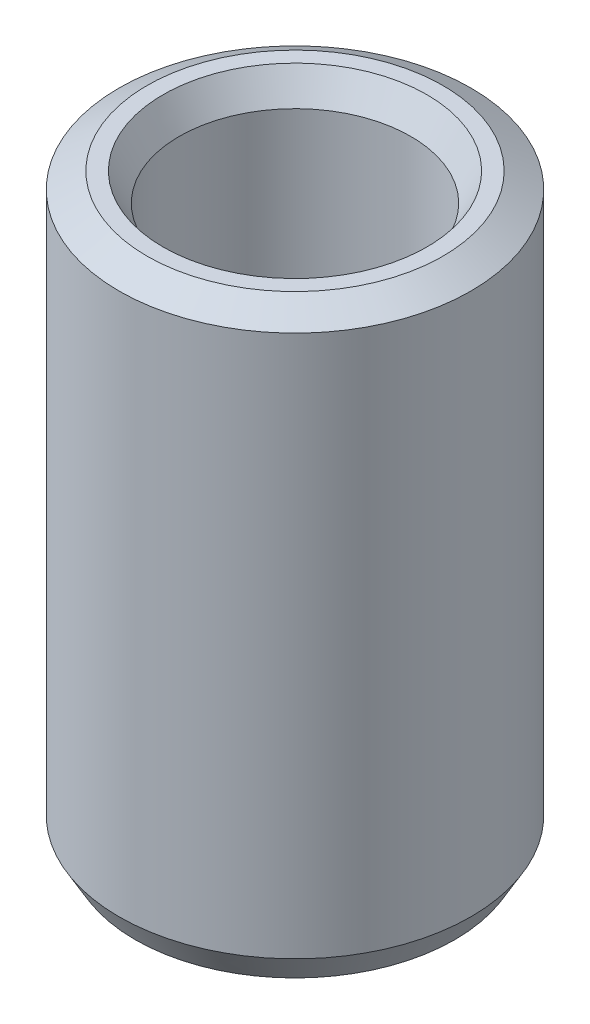
ISO-10303-21;
HEADER;
FILE_DESCRIPTION(('STEP AP214'),'2;1');
FILE_NAME('part.step','',(''),(''),'','','');
FILE_SCHEMA(('AUTOMOTIVE_DESIGN { 1 0 10303 214 1 1 1 1 }'));
ENDSEC;
DATA;
#1=APPLICATION_CONTEXT('core data for automotive mechanical design processes');
#2=APPLICATION_PROTOCOL_DEFINITION('international standard','automotive_design',2000,#1);
#3=PRODUCT_CONTEXT('',#1,'mechanical');
#4=PRODUCT('Part','Part','',(#3));
#5=PRODUCT_RELATED_PRODUCT_CATEGORY('part','',(#4));
#6=PRODUCT_DEFINITION_FORMATION('','',#4);
#7=PRODUCT_DEFINITION_CONTEXT('part definition',#1,'design');
#8=PRODUCT_DEFINITION('design','',#6,#7);
#9=PRODUCT_DEFINITION_SHAPE('','',#8);
#10=(LENGTH_UNIT() NAMED_UNIT(*) SI_UNIT(.MILLI.,.METRE.));
#11=(NAMED_UNIT(*) PLANE_ANGLE_UNIT() SI_UNIT($,.RADIAN.));
#12=(NAMED_UNIT(*) SI_UNIT($,.STERADIAN.) SOLID_ANGLE_UNIT());
#13=UNCERTAINTY_MEASURE_WITH_UNIT(LENGTH_MEASURE(1.E-05),#10,'distance_accuracy_value','');
#14=(GEOMETRIC_REPRESENTATION_CONTEXT(3) GLOBAL_UNCERTAINTY_ASSIGNED_CONTEXT((#13)) GLOBAL_UNIT_ASSIGNED_CONTEXT((#10,
#11,#12)) REPRESENTATION_CONTEXT('',''));
#15=CARTESIAN_POINT('',(0.,0.,0.));
#16=DIRECTION('',(0.,0.,1.));
#17=DIRECTION('',(1.,0.,0.));
#18=AXIS2_PLACEMENT_3D('',#15,#16,#17);
#19=CARTESIAN_POINT('',(0.,41.6444468461128,0.));
#20=DIRECTION('',(0.,-1.,0.));
#21=DIRECTION('',(0.,0.,-1.));
#22=AXIS2_PLACEMENT_3D('',#19,#20,#21);
#23=CYLINDRICAL_SURFACE('',#22,12.5);
#24=CARTESIAN_POINT('',(0.,1.99027110422233,0.));
#25=DIRECTION('',(0.,1.,0.));
#26=DIRECTION('',(0.,0.,1.));
#27=AXIS2_PLACEMENT_3D('',#24,#25,#26);
#28=CIRCLE('',#27,12.5);
#29=CARTESIAN_POINT('',(0.,1.99027110422233,12.5));
#30=VERTEX_POINT('',#29);
#31=EDGE_CURVE('E10',#30,#30,#28,.T.);
#32=ORIENTED_EDGE('',*,*,#31,.T.);
#33=EDGE_LOOP('',(#32));
#34=FACE_BOUND('',#33,.T.);
#35=CARTESIAN_POINT('',(0.,40.4953632883297,0.));
#36=DIRECTION('',(0.,1.,0.));
#37=DIRECTION('',(0.,0.,1.));
#38=AXIS2_PLACEMENT_3D('',#35,#36,#37);
#39=CIRCLE('',#38,12.5);
#40=CARTESIAN_POINT('',(0.,40.4953632883297,12.5));
#41=VERTEX_POINT('',#40);
#42=EDGE_CURVE('E50',#41,#41,#39,.F.);
#43=ORIENTED_EDGE('',*,*,#42,.T.);
#44=EDGE_LOOP('',(#43));
#45=FACE_BOUND('',#44,.T.);
#46=ADVANCED_FACE('F39',(#34,#45),#23,.T.);
#47=CARTESIAN_POINT('',(0.,41.6444468461128,0.));
#48=DIRECTION('',(0.,1.,0.));
#49=DIRECTION('',(0.,0.,1.));
#50=AXIS2_PLACEMENT_3D('',#47,#48,#49);
#51=PLANE('',#50);
#52=CARTESIAN_POINT('',(0.,41.6444468461128,0.));
#53=DIRECTION('',(0.,1.,0.));
#54=DIRECTION('',(0.,0.,1.));
#55=AXIS2_PLACEMENT_3D('',#52,#53,#54);
#56=CIRCLE('',#55,9.37646301380591);
#57=CARTESIAN_POINT('',(0.,41.6444468461128,9.37646301380591));
#58=VERTEX_POINT('',#57);
#59=EDGE_CURVE('E58',#58,#58,#56,.F.);
#60=ORIENTED_EDGE('',*,*,#59,.T.);
#61=EDGE_LOOP('',(#60));
#62=FACE_BOUND('',#61,.T.);
#63=CARTESIAN_POINT('',(0.,41.6444468461128,0.));
#64=DIRECTION('',(0.,1.,0.));
#65=DIRECTION('',(0.,0.,1.));
#66=AXIS2_PLACEMENT_3D('',#63,#64,#65);
#67=CIRCLE('',#66,10.5097288957777);
#68=CARTESIAN_POINT('',(0.,41.6444468461128,10.5097288957777));
#69=VERTEX_POINT('',#68);
#70=EDGE_CURVE('E61',#69,#69,#67,.T.);
#71=ORIENTED_EDGE('',*,*,#70,.T.);
#72=EDGE_LOOP('',(#71));
#73=FACE_BOUND('',#72,.T.);
#74=ADVANCED_FACE('F88',(#62,#73),#51,.T.);
#75=CARTESIAN_POINT('',(0.,0.,0.));
#76=DIRECTION('',(0.,1.,0.));
#77=DIRECTION('',(0.,0.,1.));
#78=AXIS2_PLACEMENT_3D('',#75,#76,#77);
#79=PLANE('',#78);
#80=CARTESIAN_POINT('',(0.,0.,0.));
#81=DIRECTION('',(0.,1.,0.));
#82=DIRECTION('',(0.,0.,1.));
#83=AXIS2_PLACEMENT_3D('',#80,#81,#82);
#84=CIRCLE('',#83,10.2176505602451);
#85=CARTESIAN_POINT('',(0.,0.,10.2176505602451));
#86=VERTEX_POINT('',#85);
#87=EDGE_CURVE('E51',#86,#86,#84,.T.);
#88=ORIENTED_EDGE('',*,*,#87,.T.);
#89=EDGE_LOOP('',(#88));
#90=FACE_BOUND('',#89,.T.);
#91=CARTESIAN_POINT('',(0.,0.,0.));
#92=DIRECTION('',(0.,1.,0.));
#93=DIRECTION('',(0.,0.,1.));
#94=AXIS2_PLACEMENT_3D('',#91,#92,#93);
#95=CIRCLE('',#94,11.3509164422169);
#96=CARTESIAN_POINT('',(0.,0.,11.3509164422169));
#97=VERTEX_POINT('',#96);
#98=EDGE_CURVE('E54',#97,#97,#95,.F.);
#99=ORIENTED_EDGE('',*,*,#98,.T.);
#100=EDGE_LOOP('',(#99));
#101=FACE_BOUND('',#100,.T.);
#102=ADVANCED_FACE('F83',(#90,#101),#79,.F.);
#103=CARTESIAN_POINT('',(0.,41.6444468461128,0.));
#104=DIRECTION('',(0.,-1.,0.));
#105=DIRECTION('',(0.,0.,-1.));
#106=AXIS2_PLACEMENT_3D('',#103,#104,#105);
#107=CYLINDRICAL_SURFACE('',#106,8.22737945602282);
#108=CARTESIAN_POINT('',(0.,39.6541757418905,0.));
#109=DIRECTION('',(0.,1.,0.));
#110=DIRECTION('',(0.,0.,1.));
#111=AXIS2_PLACEMENT_3D('',#108,#109,#110);
#112=CIRCLE('',#111,8.22737945602282);
#113=CARTESIAN_POINT('',(0.,39.6541757418905,8.22737945602282));
#114=VERTEX_POINT('',#113);
#115=EDGE_CURVE('E67',#114,#114,#112,.T.);
#116=ORIENTED_EDGE('',*,*,#115,.T.);
#117=EDGE_LOOP('',(#116));
#118=FACE_BOUND('',#117,.T.);
#119=CARTESIAN_POINT('',(0.,1.1490835577831,0.));
#120=DIRECTION('',(0.,1.,0.));
#121=DIRECTION('',(0.,0.,1.));
#122=AXIS2_PLACEMENT_3D('',#119,#120,#121);
#123=CIRCLE('',#122,8.22737945602282);
#124=CARTESIAN_POINT('',(0.,1.1490835577831,8.22737945602282));
#125=VERTEX_POINT('',#124);
#126=EDGE_CURVE('E69',#125,#125,#123,.F.);
#127=ORIENTED_EDGE('',*,*,#126,.T.);
#128=EDGE_LOOP('',(#127));
#129=FACE_BOUND('',#128,.T.);
#130=ADVANCED_FACE('F71',(#118,#129),#107,.F.);
#131=CARTESIAN_POINT('',(0.,39.6541757418905,0.));
#132=DIRECTION('',(0.,1.,0.));
#133=DIRECTION('',(0.,0.,1.));
#134=AXIS2_PLACEMENT_3D('',#131,#132,#133);
#135=CONICAL_SURFACE('',#134,8.22737945602282,0.523598775598303);
#136=ORIENTED_EDGE('',*,*,#59,.F.);
#137=EDGE_LOOP('',(#136));
#138=FACE_BOUND('',#137,.T.);
#139=ORIENTED_EDGE('',*,*,#115,.F.);
#140=EDGE_LOOP('',(#139));
#141=FACE_BOUND('',#140,.T.);
#142=ADVANCED_FACE('F77',(#138,#141),#135,.F.);
#143=CARTESIAN_POINT('',(0.,0.,0.));
#144=DIRECTION('',(0.,-1.,0.));
#145=DIRECTION('',(0.,0.,-1.));
#146=AXIS2_PLACEMENT_3D('',#143,#144,#145);
#147=CONICAL_SURFACE('',#146,10.2176505602451,1.04719755119659);
#148=ORIENTED_EDGE('',*,*,#126,.F.);
#149=EDGE_LOOP('',(#148));
#150=FACE_BOUND('',#149,.T.);
#151=ORIENTED_EDGE('',*,*,#87,.F.);
#152=EDGE_LOOP('',(#151));
#153=FACE_BOUND('',#152,.T.);
#154=ADVANCED_FACE('F73',(#150,#153),#147,.F.);
#155=CARTESIAN_POINT('',(0.,1.99027110422233,0.));
#156=DIRECTION('',(0.,1.,0.));
#157=DIRECTION('',(0.,0.,1.));
#158=AXIS2_PLACEMENT_3D('',#155,#156,#157);
#159=CONICAL_SURFACE('',#158,12.5,0.523598775598305);
#160=ORIENTED_EDGE('',*,*,#98,.F.);
#161=EDGE_LOOP('',(#160));
#162=FACE_BOUND('',#161,.T.);
#163=ORIENTED_EDGE('',*,*,#31,.F.);
#164=EDGE_LOOP('',(#163));
#165=FACE_BOUND('',#164,.T.);
#166=ADVANCED_FACE('F76',(#162,#165),#159,.T.);
#167=CARTESIAN_POINT('',(0.,41.6444468461128,0.));
#168=DIRECTION('',(0.,-1.,0.));
#169=DIRECTION('',(0.,0.,-1.));
#170=AXIS2_PLACEMENT_3D('',#167,#168,#169);
#171=CONICAL_SURFACE('',#170,10.5097288957777,1.04719755119659);
#172=ORIENTED_EDGE('',*,*,#42,.F.);
#173=EDGE_LOOP('',(#172));
#174=FACE_BOUND('',#173,.T.);
#175=ORIENTED_EDGE('',*,*,#70,.F.);
#176=EDGE_LOOP('',(#175));
#177=FACE_BOUND('',#176,.T.);
#178=ADVANCED_FACE('F45',(#174,#177),#171,.T.);
#179=CLOSED_SHELL('',(#46,#74,#102,#130,#142,#154,#166,#178));
#180=MANIFOLD_SOLID_BREP('B2',#179);
#181=ADVANCED_BREP_SHAPE_REPRESENTATION('',(#18,#180),#14);
#182=SHAPE_DEFINITION_REPRESENTATION(#9,#181);
ENDSEC;
END-ISO-10303-21;
